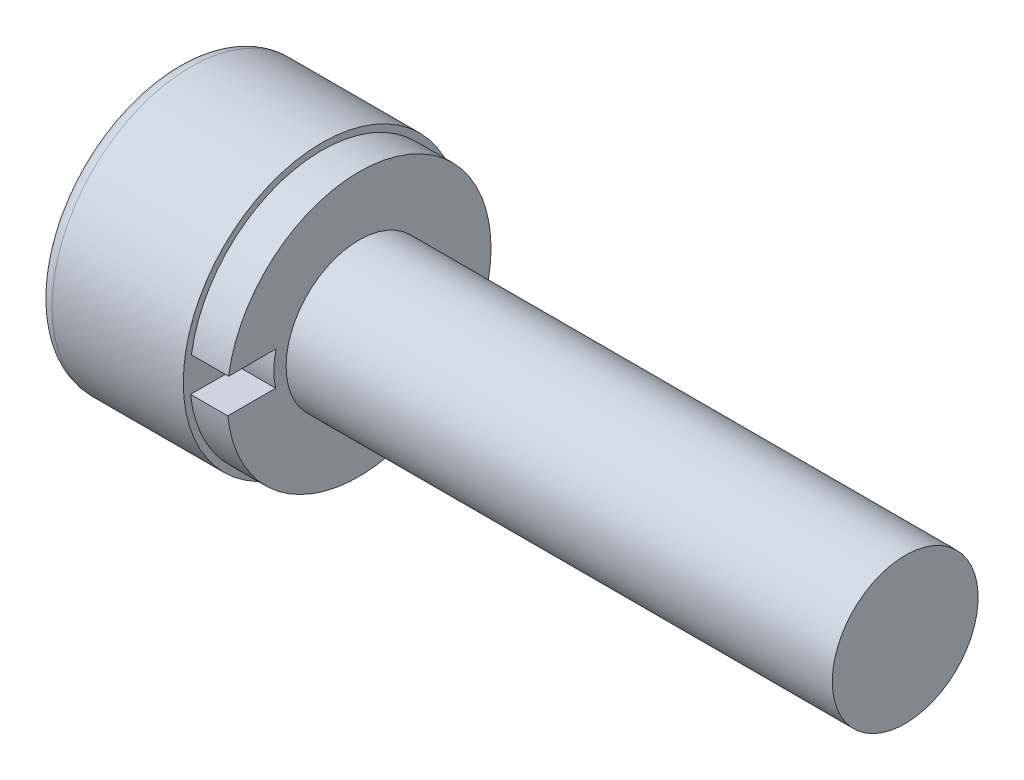
ISO-10303-21;
HEADER;
FILE_DESCRIPTION(('STEP AP214'),'2;1');
FILE_NAME('part.step','',(''),(''),'','','');
FILE_SCHEMA(('AUTOMOTIVE_DESIGN { 1 0 10303 214 1 1 1 1 }'));
ENDSEC;
DATA;
#1=APPLICATION_CONTEXT('core data for automotive mechanical design processes');
#2=APPLICATION_PROTOCOL_DEFINITION('international standard','automotive_design',2000,#1);
#3=PRODUCT_CONTEXT('',#1,'mechanical');
#4=PRODUCT('Part','Part','',(#3));
#5=PRODUCT_RELATED_PRODUCT_CATEGORY('part','',(#4));
#6=PRODUCT_DEFINITION_FORMATION('','',#4);
#7=PRODUCT_DEFINITION_CONTEXT('part definition',#1,'design');
#8=PRODUCT_DEFINITION('design','',#6,#7);
#9=PRODUCT_DEFINITION_SHAPE('','',#8);
#10=(LENGTH_UNIT() NAMED_UNIT(*) SI_UNIT(.MILLI.,.METRE.));
#11=(NAMED_UNIT(*) PLANE_ANGLE_UNIT() SI_UNIT($,.RADIAN.));
#12=(NAMED_UNIT(*) SI_UNIT($,.STERADIAN.) SOLID_ANGLE_UNIT());
#13=UNCERTAINTY_MEASURE_WITH_UNIT(LENGTH_MEASURE(1.E-05),#10,'distance_accuracy_value','');
#14=(GEOMETRIC_REPRESENTATION_CONTEXT(3) GLOBAL_UNCERTAINTY_ASSIGNED_CONTEXT((#13)) GLOBAL_UNIT_ASSIGNED_CONTEXT((#10,
#11,#12)) REPRESENTATION_CONTEXT('',''));
#15=CARTESIAN_POINT('',(0.,0.,0.));
#16=DIRECTION('',(0.,0.,1.));
#17=DIRECTION('',(1.,0.,0.));
#18=AXIS2_PLACEMENT_3D('',#15,#16,#17);
#19=CARTESIAN_POINT('',(2.51,1.81,0.));
#20=DIRECTION('',(-1.,0.,0.));
#21=DIRECTION('',(0.,0.,1.));
#22=AXIS2_PLACEMENT_3D('',#19,#20,#21);
#23=PLANE('',#22);
#24=CARTESIAN_POINT('',(2.51,0.,0.));
#25=DIRECTION('',(-1.,0.,0.));
#26=DIRECTION('',(0.,0.,1.));
#27=AXIS2_PLACEMENT_3D('',#24,#25,#26);
#28=CIRCLE('',#27,1.);
#29=CARTESIAN_POINT('',(2.51,0.,1.));
#30=VERTEX_POINT('',#29);
#31=EDGE_CURVE('E139',#30,#30,#28,.T.);
#32=ORIENTED_EDGE('',*,*,#31,.T.);
#33=EDGE_LOOP('',(#32));
#34=FACE_BOUND('',#33,.T.);
#35=CARTESIAN_POINT('',(2.51,0.,0.));
#36=DIRECTION('',(-1.,0.,0.));
#37=DIRECTION('',(0.,0.,1.));
#38=AXIS2_PLACEMENT_3D('',#35,#36,#37);
#39=CIRCLE('',#38,1.81);
#40=CARTESIAN_POINT('',(2.51,0.275804569322458,1.78886328139991));
#41=VERTEX_POINT('',#40);
#42=CARTESIAN_POINT('',(2.51,-0.18852896908553,1.80015466774818));
#43=VERTEX_POINT('',#42);
#44=EDGE_CURVE('E135',#41,#43,#39,.T.);
#45=ORIENTED_EDGE('',*,*,#44,.F.);
#46=DIRECTION('',(0.,0.,1.));
#47=VECTOR('',#46,1.);
#48=CARTESIAN_POINT('',(2.51,0.275804569322458,1.13894009483828));
#49=LINE('',#48,#47);
#50=CARTESIAN_POINT('',(2.51,0.275804569322458,1.13894009483828));
#51=VERTEX_POINT('',#50);
#52=EDGE_CURVE('E117',#51,#41,#49,.T.);
#53=ORIENTED_EDGE('',*,*,#52,.F.);
#54=CARTESIAN_POINT('',(2.51,0.034911089979096,0.168388534327535));
#55=DIRECTION('',(-1.,0.,0.));
#56=DIRECTION('',(0.,0.,-1.));
#57=AXIS2_PLACEMENT_3D('',#54,#55,#56);
#58=CIRCLE('',#57,1.);
#59=CARTESIAN_POINT('',(2.51,-0.18852896908553,1.14310620627424));
#60=VERTEX_POINT('',#59);
#61=EDGE_CURVE('E322',#60,#51,#58,.T.);
#62=ORIENTED_EDGE('',*,*,#61,.F.);
#63=DIRECTION('',(0.,0.,-1.));
#64=VECTOR('',#63,1.);
#65=CARTESIAN_POINT('',(2.51,-0.18852896908553,1.80015466774818));
#66=LINE('',#65,#64);
#67=EDGE_CURVE('E49',#43,#60,#66,.T.);
#68=ORIENTED_EDGE('',*,*,#67,.F.);
#69=EDGE_LOOP('',(#45,#53,#62,#68));
#70=FACE_BOUND('',#69,.T.);
#71=ADVANCED_FACE('F34',(#34,#70),#23,.F.);
#72=CARTESIAN_POINT('',(0.,0.,0.));
#73=DIRECTION('',(1.,0.,0.));
#74=DIRECTION('',(0.,0.,-1.));
#75=AXIS2_PLACEMENT_3D('',#72,#73,#74);
#76=PLANE('',#75);
#77=CARTESIAN_POINT('',(0.,0.,0.));
#78=DIRECTION('',(1.,0.,0.));
#79=DIRECTION('',(0.,0.,-1.));
#80=AXIS2_PLACEMENT_3D('',#77,#78,#79);
#81=CIRCLE('',#80,1.7);
#82=CARTESIAN_POINT('',(0.,0.,-1.7));
#83=VERTEX_POINT('',#82);
#84=EDGE_CURVE('E42',#83,#83,#81,.F.);
#85=ORIENTED_EDGE('',*,*,#84,.T.);
#86=EDGE_LOOP('',(#85));
#87=FACE_BOUND('',#86,.T.);
#88=DIRECTION('',(0.,0.906636945036993,0.421911661244374));
#89=VECTOR('',#88,1.);
#90=CARTESIAN_POINT('',(0.,-0.727926234049432,0.51054552305935));
#91=LINE('',#90,#89);
#92=CARTESIAN_POINT('',(0.,-0.727926234049432,0.51054552305935));
#93=VERTEX_POINT('',#92);
#94=CARTESIAN_POINT('',(0.,0.0781822757330951,0.88567537229762));
#95=VERTEX_POINT('',#94);
#96=EDGE_CURVE('E355',#93,#95,#91,.T.);
#97=ORIENTED_EDGE('',*,*,#96,.F.);
#98=DIRECTION('',(0.,0.087932255727974,0.996126457033739));
#99=VECTOR('',#98,1.);
#100=CARTESIAN_POINT('',(0.,-0.806108509782527,-0.37512984923827));
#101=LINE('',#100,#99);
#102=CARTESIAN_POINT('',(0.,-0.806108509782527,-0.37512984923827));
#103=VERTEX_POINT('',#102);
#104=EDGE_CURVE('E57',#103,#93,#101,.T.);
#105=ORIENTED_EDGE('',*,*,#104,.F.);
#106=DIRECTION('',(0.,-0.81870468930902,0.574214795789365));
#107=VECTOR('',#106,1.);
#108=CARTESIAN_POINT('',(0.,-0.0781822757330952,-0.885675372297619));
#109=LINE('',#108,#107);
#110=CARTESIAN_POINT('',(0.,-0.0781822757330952,-0.885675372297619));
#111=VERTEX_POINT('',#110);
#112=EDGE_CURVE('E338',#111,#103,#109,.T.);
#113=ORIENTED_EDGE('',*,*,#112,.F.);
#114=DIRECTION('',(0.,-0.906636945036993,-0.421911661244375));
#115=VECTOR('',#114,1.);
#116=CARTESIAN_POINT('',(0.,0.727926234049431,-0.51054552305935));
#117=LINE('',#116,#115);
#118=CARTESIAN_POINT('',(0.,0.727926234049431,-0.51054552305935));
#119=VERTEX_POINT('',#118);
#120=EDGE_CURVE('E364',#119,#111,#117,.T.);
#121=ORIENTED_EDGE('',*,*,#120,.F.);
#122=DIRECTION('',(0.,-0.0879322557279739,-0.996126457033739));
#123=VECTOR('',#122,1.);
#124=CARTESIAN_POINT('',(0.,0.806108509782526,0.37512984923827));
#125=LINE('',#124,#123);
#126=CARTESIAN_POINT('',(0.,0.806108509782526,0.37512984923827));
#127=VERTEX_POINT('',#126);
#128=EDGE_CURVE('E361',#127,#119,#125,.T.);
#129=ORIENTED_EDGE('',*,*,#128,.F.);
#130=DIRECTION('',(0.,0.818704689309019,-0.574214795789365));
#131=VECTOR('',#130,1.);
#132=CARTESIAN_POINT('',(0.,0.0781822757330951,0.88567537229762));
#133=LINE('',#132,#131);
#134=EDGE_CURVE('E358',#95,#127,#133,.T.);
#135=ORIENTED_EDGE('',*,*,#134,.F.);
#136=EDGE_LOOP('',(#97,#105,#113,#121,#129,#135));
#137=FACE_BOUND('',#136,.T.);
#138=ADVANCED_FACE('F145',(#87,#137),#76,.F.);
#139=CARTESIAN_POINT('',(0.,0.,0.));
#140=DIRECTION('',(-1.,0.,0.));
#141=DIRECTION('',(0.,0.,1.));
#142=AXIS2_PLACEMENT_3D('',#139,#140,#141);
#143=CYLINDRICAL_SURFACE('',#142,1.9);
#144=CARTESIAN_POINT('',(0.2,0.,0.));
#145=DIRECTION('',(1.,0.,0.));
#146=DIRECTION('',(0.,0.,-1.));
#147=AXIS2_PLACEMENT_3D('',#144,#145,#146);
#148=CIRCLE('',#147,1.9);
#149=CARTESIAN_POINT('',(0.2,0.,-1.9));
#150=VERTEX_POINT('',#149);
#151=EDGE_CURVE('E11',#150,#150,#148,.T.);
#152=ORIENTED_EDGE('',*,*,#151,.T.);
#153=EDGE_LOOP('',(#152));
#154=FACE_BOUND('',#153,.T.);
#155=CARTESIAN_POINT('',(2.,0.,0.));
#156=DIRECTION('',(-1.,0.,0.));
#157=DIRECTION('',(0.,0.,1.));
#158=AXIS2_PLACEMENT_3D('',#155,#156,#157);
#159=CIRCLE('',#158,1.9);
#160=CARTESIAN_POINT('',(2.,0.,1.9));
#161=VERTEX_POINT('',#160);
#162=EDGE_CURVE('E134',#161,#161,#159,.T.);
#163=ORIENTED_EDGE('',*,*,#162,.T.);
#164=EDGE_LOOP('',(#163));
#165=FACE_BOUND('',#164,.T.);
#166=ADVANCED_FACE('F167',(#154,#165),#143,.T.);
#167=CARTESIAN_POINT('',(2.,1.9,0.));
#168=DIRECTION('',(-1.,0.,0.));
#169=DIRECTION('',(0.,0.,1.));
#170=AXIS2_PLACEMENT_3D('',#167,#168,#169);
#171=PLANE('',#170);
#172=ORIENTED_EDGE('',*,*,#162,.F.);
#173=EDGE_LOOP('',(#172));
#174=FACE_BOUND('',#173,.T.);
#175=CARTESIAN_POINT('',(2.,0.,0.));
#176=DIRECTION('',(-1.,0.,0.));
#177=DIRECTION('',(0.,0.,1.));
#178=AXIS2_PLACEMENT_3D('',#175,#176,#177);
#179=CIRCLE('',#178,1.81);
#180=CARTESIAN_POINT('',(2.,0.275804569322458,1.78886328139991));
#181=VERTEX_POINT('',#180);
#182=CARTESIAN_POINT('',(2.,-0.18852896908553,1.80015466774818));
#183=VERTEX_POINT('',#182);
#184=EDGE_CURVE('E128',#181,#183,#179,.T.);
#185=ORIENTED_EDGE('',*,*,#184,.T.);
#186=DIRECTION('',(0.,0.,-1.));
#187=VECTOR('',#186,1.);
#188=CARTESIAN_POINT('',(2.,-0.18852896908553,1.80015466774818));
#189=LINE('',#188,#187);
#190=CARTESIAN_POINT('',(2.,-0.18852896908553,1.14310620627424));
#191=VERTEX_POINT('',#190);
#192=EDGE_CURVE('E323',#183,#191,#189,.T.);
#193=ORIENTED_EDGE('',*,*,#192,.T.);
#194=CARTESIAN_POINT('',(2.,0.034911089979096,0.168388534327535));
#195=DIRECTION('',(-1.,0.,0.));
#196=DIRECTION('',(0.,0.,1.));
#197=AXIS2_PLACEMENT_3D('',#194,#195,#196);
#198=CIRCLE('',#197,1.);
#199=CARTESIAN_POINT('',(2.,0.275804569322458,1.13894009483828));
#200=VERTEX_POINT('',#199);
#201=EDGE_CURVE('E129',#191,#200,#198,.T.);
#202=ORIENTED_EDGE('',*,*,#201,.T.);
#203=DIRECTION('',(0.,0.,1.));
#204=VECTOR('',#203,1.);
#205=CARTESIAN_POINT('',(2.,0.275804569322458,1.13894009483828));
#206=LINE('',#205,#204);
#207=EDGE_CURVE('E114',#200,#181,#206,.T.);
#208=ORIENTED_EDGE('',*,*,#207,.T.);
#209=EDGE_LOOP('',(#185,#193,#202,#208));
#210=FACE_BOUND('',#209,.T.);
#211=ADVANCED_FACE('F126',(#174,#210),#171,.F.);
#212=CARTESIAN_POINT('',(0.,0.,0.));
#213=DIRECTION('',(-1.,0.,0.));
#214=DIRECTION('',(0.,0.,1.));
#215=AXIS2_PLACEMENT_3D('',#212,#213,#214);
#216=CYLINDRICAL_SURFACE('',#215,1.81);
#217=ORIENTED_EDGE('',*,*,#184,.F.);
#218=DIRECTION('',(1.,0.,0.));
#219=VECTOR('',#218,1.);
#220=CARTESIAN_POINT('',(1.18395647713732,0.275804569322458,1.78886328139991));
#221=LINE('',#220,#219);
#222=EDGE_CURVE('E111',#181,#41,#221,.T.);
#223=ORIENTED_EDGE('',*,*,#222,.T.);
#224=ORIENTED_EDGE('',*,*,#44,.T.);
#225=DIRECTION('',(1.,0.,0.));
#226=VECTOR('',#225,1.);
#227=CARTESIAN_POINT('',(1.18395647713732,-0.18852896908553,1.80015466774818));
#228=LINE('',#227,#226);
#229=EDGE_CURVE('E122',#183,#43,#228,.T.);
#230=ORIENTED_EDGE('',*,*,#229,.F.);
#231=EDGE_LOOP('',(#217,#223,#224,#230));
#232=FACE_BOUND('',#231,.T.);
#233=ADVANCED_FACE('F133',(#232),#216,.T.);
#234=CARTESIAN_POINT('',(0.,0.,0.));
#235=DIRECTION('',(-1.,0.,0.));
#236=DIRECTION('',(0.,0.,1.));
#237=AXIS2_PLACEMENT_3D('',#234,#235,#236);
#238=CYLINDRICAL_SURFACE('',#237,1.);
#239=ORIENTED_EDGE('',*,*,#31,.F.);
#240=EDGE_LOOP('',(#239));
#241=FACE_BOUND('',#240,.T.);
#242=CARTESIAN_POINT('',(10.,0.,0.));
#243=DIRECTION('',(-1.,0.,0.));
#244=DIRECTION('',(0.,0.,1.));
#245=AXIS2_PLACEMENT_3D('',#242,#243,#244);
#246=CIRCLE('',#245,1.);
#247=CARTESIAN_POINT('',(10.,0.,1.));
#248=VERTEX_POINT('',#247);
#249=EDGE_CURVE('E371',#248,#248,#246,.T.);
#250=ORIENTED_EDGE('',*,*,#249,.T.);
#251=EDGE_LOOP('',(#250));
#252=FACE_BOUND('',#251,.T.);
#253=ADVANCED_FACE('F172',(#241,#252),#238,.T.);
#254=CARTESIAN_POINT('',(10.,1.,0.));
#255=DIRECTION('',(-1.,0.,0.));
#256=DIRECTION('',(0.,0.,1.));
#257=AXIS2_PLACEMENT_3D('',#254,#255,#256);
#258=PLANE('',#257);
#259=ORIENTED_EDGE('',*,*,#249,.F.);
#260=EDGE_LOOP('',(#259));
#261=FACE_BOUND('',#260,.T.);
#262=ADVANCED_FACE('F202',(#261),#258,.F.);
#263=CARTESIAN_POINT('',(1.,-0.806108509782527,-0.37512984923827));
#264=DIRECTION('',(0.,-0.996126457033739,0.087932255727974));
#265=DIRECTION('',(0.,-0.087932255727974,-0.996126457033739));
#266=AXIS2_PLACEMENT_3D('',#263,#264,#265);
#267=PLANE('',#266);
#268=ORIENTED_EDGE('',*,*,#104,.T.);
#269=DIRECTION('',(-1.,0.,0.));
#270=VECTOR('',#269,1.);
#271=CARTESIAN_POINT('',(1.,-0.727926234049432,0.51054552305935));
#272=LINE('',#271,#270);
#273=CARTESIAN_POINT('',(1.,-0.727926234049432,0.51054552305935));
#274=VERTEX_POINT('',#273);
#275=EDGE_CURVE('E353',#274,#93,#272,.T.);
#276=ORIENTED_EDGE('',*,*,#275,.F.);
#277=DIRECTION('',(0.,0.087932255727974,0.996126457033739));
#278=VECTOR('',#277,1.);
#279=CARTESIAN_POINT('',(1.,-0.806108509782527,-0.37512984923827));
#280=LINE('',#279,#278);
#281=CARTESIAN_POINT('',(1.,-0.806108509782527,-0.37512984923827));
#282=VERTEX_POINT('',#281);
#283=EDGE_CURVE('E334',#282,#274,#280,.T.);
#284=ORIENTED_EDGE('',*,*,#283,.F.);
#285=DIRECTION('',(-1.,0.,0.));
#286=VECTOR('',#285,1.);
#287=CARTESIAN_POINT('',(1.,-0.806108509782527,-0.37512984923827));
#288=LINE('',#287,#286);
#289=EDGE_CURVE('E369',#282,#103,#288,.T.);
#290=ORIENTED_EDGE('',*,*,#289,.T.);
#291=EDGE_LOOP('',(#268,#276,#284,#290));
#292=FACE_BOUND('',#291,.T.);
#293=ADVANCED_FACE('F209',(#292),#267,.F.);
#294=CARTESIAN_POINT('',(1.,-0.0781822757330952,-0.885675372297619));
#295=DIRECTION('',(0.,-0.574214795789365,-0.81870468930902));
#296=DIRECTION('',(0.,0.81870468930902,-0.574214795789365));
#297=AXIS2_PLACEMENT_3D('',#294,#295,#296);
#298=PLANE('',#297);
#299=ORIENTED_EDGE('',*,*,#112,.T.);
#300=ORIENTED_EDGE('',*,*,#289,.F.);
#301=DIRECTION('',(0.,-0.81870468930902,0.574214795789365));
#302=VECTOR('',#301,1.);
#303=CARTESIAN_POINT('',(1.,-0.0781822757330952,-0.885675372297619));
#304=LINE('',#303,#302);
#305=CARTESIAN_POINT('',(1.,-0.0781822757330952,-0.885675372297619));
#306=VERTEX_POINT('',#305);
#307=EDGE_CURVE('E350',#306,#282,#304,.T.);
#308=ORIENTED_EDGE('',*,*,#307,.F.);
#309=DIRECTION('',(-1.,0.,0.));
#310=VECTOR('',#309,1.);
#311=CARTESIAN_POINT('',(1.,-0.0781822757330952,-0.885675372297619));
#312=LINE('',#311,#310);
#313=EDGE_CURVE('E372',#306,#111,#312,.T.);
#314=ORIENTED_EDGE('',*,*,#313,.T.);
#315=EDGE_LOOP('',(#299,#300,#308,#314));
#316=FACE_BOUND('',#315,.T.);
#317=ADVANCED_FACE('F216',(#316),#298,.F.);
#318=CARTESIAN_POINT('',(1.,0.727926234049431,-0.51054552305935));
#319=DIRECTION('',(0.,0.421911661244375,-0.906636945036993));
#320=DIRECTION('',(0.,0.906636945036993,0.421911661244375));
#321=AXIS2_PLACEMENT_3D('',#318,#319,#320);
#322=PLANE('',#321);
#323=ORIENTED_EDGE('',*,*,#120,.T.);
#324=ORIENTED_EDGE('',*,*,#313,.F.);
#325=DIRECTION('',(0.,-0.906636945036993,-0.421911661244375));
#326=VECTOR('',#325,1.);
#327=CARTESIAN_POINT('',(1.,0.727926234049431,-0.51054552305935));
#328=LINE('',#327,#326);
#329=CARTESIAN_POINT('',(1.,0.727926234049431,-0.51054552305935));
#330=VERTEX_POINT('',#329);
#331=EDGE_CURVE('E347',#330,#306,#328,.T.);
#332=ORIENTED_EDGE('',*,*,#331,.F.);
#333=DIRECTION('',(-1.,0.,0.));
#334=VECTOR('',#333,1.);
#335=CARTESIAN_POINT('',(1.,0.727926234049431,-0.51054552305935));
#336=LINE('',#335,#334);
#337=EDGE_CURVE('E374',#330,#119,#336,.T.);
#338=ORIENTED_EDGE('',*,*,#337,.T.);
#339=EDGE_LOOP('',(#323,#324,#332,#338));
#340=FACE_BOUND('',#339,.T.);
#341=ADVANCED_FACE('F223',(#340),#322,.F.);
#342=CARTESIAN_POINT('',(1.,0.806108509782526,0.37512984923827));
#343=DIRECTION('',(0.,0.996126457033739,-0.0879322557279739));
#344=DIRECTION('',(0.,0.0879322557279739,0.996126457033739));
#345=AXIS2_PLACEMENT_3D('',#342,#343,#344);
#346=PLANE('',#345);
#347=ORIENTED_EDGE('',*,*,#128,.T.);
#348=ORIENTED_EDGE('',*,*,#337,.F.);
#349=DIRECTION('',(0.,-0.0879322557279739,-0.996126457033739));
#350=VECTOR('',#349,1.);
#351=CARTESIAN_POINT('',(1.,0.806108509782526,0.37512984923827));
#352=LINE('',#351,#350);
#353=CARTESIAN_POINT('',(1.,0.806108509782526,0.37512984923827));
#354=VERTEX_POINT('',#353);
#355=EDGE_CURVE('E344',#354,#330,#352,.T.);
#356=ORIENTED_EDGE('',*,*,#355,.F.);
#357=DIRECTION('',(-1.,0.,0.));
#358=VECTOR('',#357,1.);
#359=CARTESIAN_POINT('',(1.,0.806108509782526,0.37512984923827));
#360=LINE('',#359,#358);
#361=EDGE_CURVE('E376',#354,#127,#360,.T.);
#362=ORIENTED_EDGE('',*,*,#361,.T.);
#363=EDGE_LOOP('',(#347,#348,#356,#362));
#364=FACE_BOUND('',#363,.T.);
#365=ADVANCED_FACE('F231',(#364),#346,.F.);
#366=CARTESIAN_POINT('',(1.,0.0781822757330951,0.88567537229762));
#367=DIRECTION('',(0.,0.574214795789365,0.81870468930902));
#368=DIRECTION('',(0.,-0.81870468930902,0.574214795789365));
#369=AXIS2_PLACEMENT_3D('',#366,#367,#368);
#370=PLANE('',#369);
#371=ORIENTED_EDGE('',*,*,#134,.T.);
#372=ORIENTED_EDGE('',*,*,#361,.F.);
#373=DIRECTION('',(0.,0.818704689309019,-0.574214795789365));
#374=VECTOR('',#373,1.);
#375=CARTESIAN_POINT('',(1.,0.0781822757330951,0.88567537229762));
#376=LINE('',#375,#374);
#377=CARTESIAN_POINT('',(1.,0.0781822757330951,0.88567537229762));
#378=VERTEX_POINT('',#377);
#379=EDGE_CURVE('E341',#378,#354,#376,.T.);
#380=ORIENTED_EDGE('',*,*,#379,.F.);
#381=DIRECTION('',(-1.,0.,0.));
#382=VECTOR('',#381,1.);
#383=CARTESIAN_POINT('',(1.,0.0781822757330951,0.88567537229762));
#384=LINE('',#383,#382);
#385=EDGE_CURVE('E378',#378,#95,#384,.T.);
#386=ORIENTED_EDGE('',*,*,#385,.T.);
#387=EDGE_LOOP('',(#371,#372,#380,#386));
#388=FACE_BOUND('',#387,.T.);
#389=ADVANCED_FACE('F239',(#388),#370,.F.);
#390=CARTESIAN_POINT('',(1.,-0.727926234049432,0.51054552305935));
#391=DIRECTION('',(0.,-0.421911661244375,0.906636945036993));
#392=DIRECTION('',(0.,-0.906636945036993,-0.421911661244375));
#393=AXIS2_PLACEMENT_3D('',#390,#391,#392);
#394=PLANE('',#393);
#395=ORIENTED_EDGE('',*,*,#96,.T.);
#396=ORIENTED_EDGE('',*,*,#385,.F.);
#397=DIRECTION('',(0.,0.906636945036993,0.421911661244374));
#398=VECTOR('',#397,1.);
#399=CARTESIAN_POINT('',(1.,-0.727926234049432,0.51054552305935));
#400=LINE('',#399,#398);
#401=EDGE_CURVE('E337',#274,#378,#400,.T.);
#402=ORIENTED_EDGE('',*,*,#401,.F.);
#403=ORIENTED_EDGE('',*,*,#275,.T.);
#404=EDGE_LOOP('',(#395,#396,#402,#403));
#405=FACE_BOUND('',#404,.T.);
#406=ADVANCED_FACE('F157',(#405),#394,.F.);
#407=CARTESIAN_POINT('',(1.,0.,0.));
#408=DIRECTION('',(-1.,0.,0.));
#409=DIRECTION('',(0.,0.,1.));
#410=AXIS2_PLACEMENT_3D('',#407,#408,#409);
#411=PLANE('',#410);
#412=ORIENTED_EDGE('',*,*,#283,.T.);
#413=ORIENTED_EDGE('',*,*,#401,.T.);
#414=ORIENTED_EDGE('',*,*,#379,.T.);
#415=ORIENTED_EDGE('',*,*,#355,.T.);
#416=ORIENTED_EDGE('',*,*,#331,.T.);
#417=ORIENTED_EDGE('',*,*,#307,.T.);
#418=EDGE_LOOP('',(#412,#413,#414,#415,#416,#417));
#419=FACE_BOUND('',#418,.T.);
#420=ADVANCED_FACE('F149',(#419),#411,.T.);
#421=CARTESIAN_POINT('',(0.2,0.,0.));
#422=DIRECTION('',(1.,0.,0.));
#423=DIRECTION('',(0.,0.,-1.));
#424=AXIS2_PLACEMENT_3D('',#421,#422,#423);
#425=TOROIDAL_SURFACE('',#424,1.7,0.2);
#426=ORIENTED_EDGE('',*,*,#151,.F.);
#427=EDGE_LOOP('',(#426));
#428=FACE_BOUND('',#427,.T.);
#429=ORIENTED_EDGE('',*,*,#84,.F.);
#430=EDGE_LOOP('',(#429));
#431=FACE_BOUND('',#430,.T.);
#432=ADVANCED_FACE('F36',(#428,#431),#425,.T.);
#433=CARTESIAN_POINT('',(1.18395647713732,0.275804569322458,1.13894009483828));
#434=DIRECTION('',(0.,1.,0.));
#435=DIRECTION('',(0.,0.,1.));
#436=AXIS2_PLACEMENT_3D('',#433,#434,#435);
#437=PLANE('',#436);
#438=DIRECTION('',(1.,0.,0.));
#439=VECTOR('',#438,1.);
#440=CARTESIAN_POINT('',(1.18395647713732,0.275804569322458,1.13894009483828));
#441=LINE('',#440,#439);
#442=EDGE_CURVE('E330',#200,#51,#441,.T.);
#443=ORIENTED_EDGE('',*,*,#442,.T.);
#444=ORIENTED_EDGE('',*,*,#52,.T.);
#445=ORIENTED_EDGE('',*,*,#222,.F.);
#446=ORIENTED_EDGE('',*,*,#207,.F.);
#447=EDGE_LOOP('',(#443,#444,#445,#446));
#448=FACE_BOUND('',#447,.T.);
#449=ADVANCED_FACE('F113',(#448),#437,.F.);
#450=CARTESIAN_POINT('',(1.18395647713732,-0.18852896908553,1.80015466774818));
#451=DIRECTION('',(0.,-1.,0.));
#452=DIRECTION('',(0.,0.,-1.));
#453=AXIS2_PLACEMENT_3D('',#450,#451,#452);
#454=PLANE('',#453);
#455=ORIENTED_EDGE('',*,*,#229,.T.);
#456=ORIENTED_EDGE('',*,*,#67,.T.);
#457=DIRECTION('',(1.,0.,0.));
#458=VECTOR('',#457,1.);
#459=CARTESIAN_POINT('',(1.18395647713732,-0.18852896908553,1.14310620627424));
#460=LINE('',#459,#458);
#461=EDGE_CURVE('E320',#191,#60,#460,.T.);
#462=ORIENTED_EDGE('',*,*,#461,.F.);
#463=ORIENTED_EDGE('',*,*,#192,.F.);
#464=EDGE_LOOP('',(#455,#456,#462,#463));
#465=FACE_BOUND('',#464,.T.);
#466=ADVANCED_FACE('F155',(#465),#454,.F.);
#467=CARTESIAN_POINT('',(1.18395647713732,0.034911089979096,0.168388534327535));
#468=DIRECTION('',(1.,0.,0.));
#469=DIRECTION('',(0.,0.,-1.));
#470=AXIS2_PLACEMENT_3D('',#467,#468,#469);
#471=CYLINDRICAL_SURFACE('',#470,1.);
#472=ORIENTED_EDGE('',*,*,#461,.T.);
#473=ORIENTED_EDGE('',*,*,#61,.T.);
#474=ORIENTED_EDGE('',*,*,#442,.F.);
#475=ORIENTED_EDGE('',*,*,#201,.F.);
#476=EDGE_LOOP('',(#472,#473,#474,#475));
#477=FACE_BOUND('',#476,.T.);
#478=ADVANCED_FACE('F306',(#477),#471,.T.);
#479=CLOSED_SHELL('',(#71,#138,#166,#211,#233,#253,#262,#293,#317,#341,#365,#389,#406,#420,#432,
#449,#466,#478));
#480=MANIFOLD_SOLID_BREP('B2',#479);
#481=ADVANCED_BREP_SHAPE_REPRESENTATION('',(#18,#480),#14);
#482=SHAPE_DEFINITION_REPRESENTATION(#9,#481);
ENDSEC;
END-ISO-10303-21;
